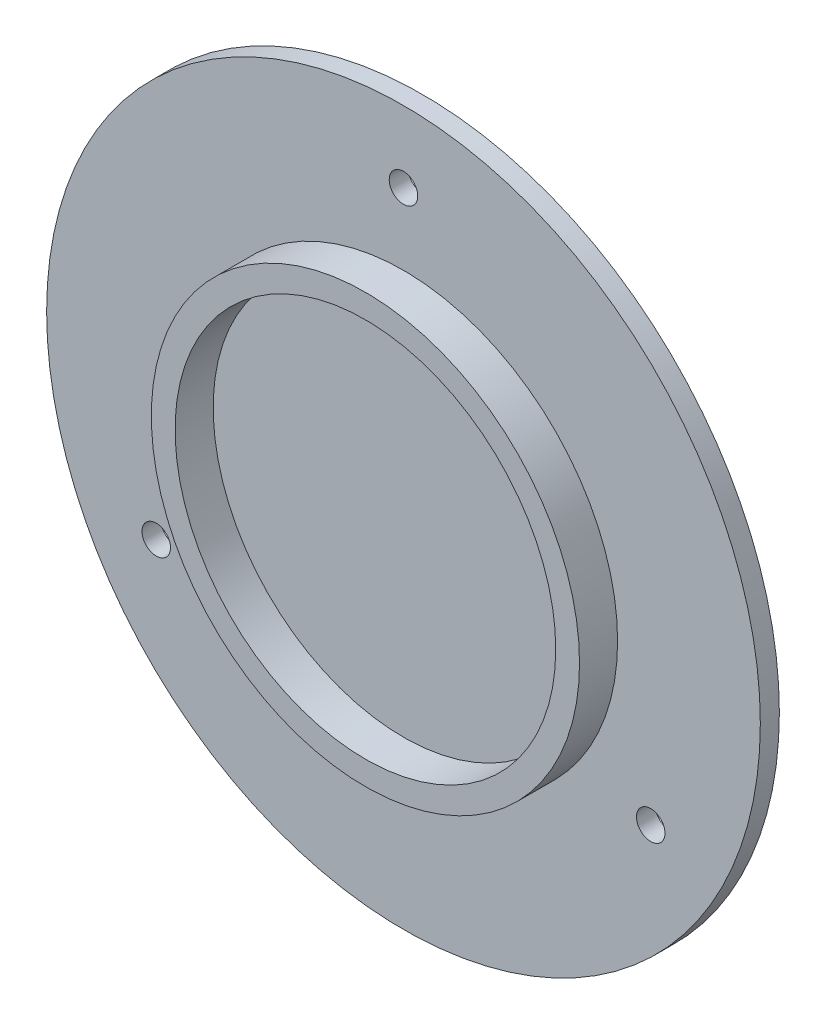
ISO-10303-21;
HEADER;
FILE_DESCRIPTION(('STEP AP214'),'2;1');
FILE_NAME('part.step','',(''),(''),'','','');
FILE_SCHEMA(('AUTOMOTIVE_DESIGN { 1 0 10303 214 1 1 1 1 }'));
ENDSEC;
DATA;
#1=APPLICATION_CONTEXT('core data for automotive mechanical design processes');
#2=APPLICATION_PROTOCOL_DEFINITION('international standard','automotive_design',2000,#1);
#3=PRODUCT_CONTEXT('',#1,'mechanical');
#4=PRODUCT('Part','Part','',(#3));
#5=PRODUCT_RELATED_PRODUCT_CATEGORY('part','',(#4));
#6=PRODUCT_DEFINITION_FORMATION('','',#4);
#7=PRODUCT_DEFINITION_CONTEXT('part definition',#1,'design');
#8=PRODUCT_DEFINITION('design','',#6,#7);
#9=PRODUCT_DEFINITION_SHAPE('','',#8);
#10=(LENGTH_UNIT() NAMED_UNIT(*) SI_UNIT(.MILLI.,.METRE.));
#11=(NAMED_UNIT(*) PLANE_ANGLE_UNIT() SI_UNIT($,.RADIAN.));
#12=(NAMED_UNIT(*) SI_UNIT($,.STERADIAN.) SOLID_ANGLE_UNIT());
#13=UNCERTAINTY_MEASURE_WITH_UNIT(LENGTH_MEASURE(1.E-05),#10,'distance_accuracy_value','');
#14=(GEOMETRIC_REPRESENTATION_CONTEXT(3) GLOBAL_UNCERTAINTY_ASSIGNED_CONTEXT((#13)) GLOBAL_UNIT_ASSIGNED_CONTEXT((#10,
#11,#12)) REPRESENTATION_CONTEXT('',''));
#15=CARTESIAN_POINT('',(0.,0.,0.));
#16=DIRECTION('',(0.,0.,1.));
#17=DIRECTION('',(1.,0.,0.));
#18=AXIS2_PLACEMENT_3D('',#15,#16,#17);
#19=CARTESIAN_POINT('',(0.,0.,4.));
#20=DIRECTION('',(0.,0.,-1.));
#21=DIRECTION('',(-1.,0.,0.));
#22=AXIS2_PLACEMENT_3D('',#19,#20,#21);
#23=CYLINDRICAL_SURFACE('',#22,75.);
#24=CARTESIAN_POINT('',(0.,0.,4.));
#25=DIRECTION('',(0.,0.,1.));
#26=DIRECTION('',(1.,0.,0.));
#27=AXIS2_PLACEMENT_3D('',#24,#25,#26);
#28=CIRCLE('',#27,75.);
#29=CARTESIAN_POINT('',(75.,0.,4.));
#30=VERTEX_POINT('',#29);
#31=EDGE_CURVE('E44',#30,#30,#28,.T.);
#32=ORIENTED_EDGE('',*,*,#31,.F.);
#33=EDGE_LOOP('',(#32));
#34=FACE_BOUND('',#33,.T.);
#35=CARTESIAN_POINT('',(0.,0.,0.));
#36=DIRECTION('',(0.,0.,1.));
#37=DIRECTION('',(1.,0.,0.));
#38=AXIS2_PLACEMENT_3D('',#35,#36,#37);
#39=CIRCLE('',#38,75.);
#40=CARTESIAN_POINT('',(75.,0.,0.));
#41=VERTEX_POINT('',#40);
#42=EDGE_CURVE('E49',#41,#41,#39,.T.);
#43=ORIENTED_EDGE('',*,*,#42,.T.);
#44=EDGE_LOOP('',(#43));
#45=FACE_BOUND('',#44,.T.);
#46=ADVANCED_FACE('F37',(#34,#45),#23,.T.);
#47=CARTESIAN_POINT('',(0.,0.,4.));
#48=DIRECTION('',(0.,0.,1.));
#49=DIRECTION('',(1.,0.,0.));
#50=AXIS2_PLACEMENT_3D('',#47,#48,#49);
#51=PLANE('',#50);
#52=CARTESIAN_POINT('',(-51.9615242270702,-29.9999999999978,4.));
#53=DIRECTION('',(0.,0.,1.));
#54=DIRECTION('',(1.,0.,0.));
#55=AXIS2_PLACEMENT_3D('',#52,#53,#54);
#56=CIRCLE('',#55,3.00000000000332);
#57=CARTESIAN_POINT('',(-48.9615242270668,-29.9999999999978,4.));
#58=VERTEX_POINT('',#57);
#59=EDGE_CURVE('E68',#58,#58,#56,.T.);
#60=ORIENTED_EDGE('',*,*,#59,.F.);
#61=EDGE_LOOP('',(#60));
#62=FACE_BOUND('',#61,.T.);
#63=CARTESIAN_POINT('',(0.,60.,4.));
#64=DIRECTION('',(0.,0.,1.));
#65=DIRECTION('',(1.,0.,0.));
#66=AXIS2_PLACEMENT_3D('',#63,#64,#65);
#67=CIRCLE('',#66,3.);
#68=CARTESIAN_POINT('',(3.,60.,4.));
#69=VERTEX_POINT('',#68);
#70=EDGE_CURVE('E72',#69,#69,#67,.T.);
#71=ORIENTED_EDGE('',*,*,#70,.F.);
#72=EDGE_LOOP('',(#71));
#73=FACE_BOUND('',#72,.T.);
#74=CARTESIAN_POINT('',(51.9615242270625,-30.0000000000022,4.));
#75=DIRECTION('',(0.,0.,1.));
#76=DIRECTION('',(1.,0.,0.));
#77=AXIS2_PLACEMENT_3D('',#74,#75,#76);
#78=CIRCLE('',#77,3.00000000000486);
#79=CARTESIAN_POINT('',(54.9615242270674,-30.0000000000022,4.));
#80=VERTEX_POINT('',#79);
#81=EDGE_CURVE('E76',#80,#80,#78,.T.);
#82=ORIENTED_EDGE('',*,*,#81,.F.);
#83=EDGE_LOOP('',(#82));
#84=FACE_BOUND('',#83,.T.);
#85=CARTESIAN_POINT('',(0.,0.,4.));
#86=DIRECTION('',(0.,0.,1.));
#87=DIRECTION('',(1.,0.,0.));
#88=AXIS2_PLACEMENT_3D('',#85,#86,#87);
#89=CIRCLE('',#88,45.);
#90=CARTESIAN_POINT('',(45.,0.,4.));
#91=VERTEX_POINT('',#90);
#92=EDGE_CURVE('E57',#91,#91,#89,.T.);
#93=ORIENTED_EDGE('',*,*,#92,.F.);
#94=EDGE_LOOP('',(#93));
#95=FACE_BOUND('',#94,.T.);
#96=ORIENTED_EDGE('',*,*,#31,.T.);
#97=EDGE_LOOP('',(#96));
#98=FACE_BOUND('',#97,.T.);
#99=ADVANCED_FACE('F99',(#62,#73,#84,#95,#98),#51,.T.);
#100=CARTESIAN_POINT('',(0.,0.,0.));
#101=DIRECTION('',(0.,0.,1.));
#102=DIRECTION('',(1.,0.,0.));
#103=AXIS2_PLACEMENT_3D('',#100,#101,#102);
#104=PLANE('',#103);
#105=CARTESIAN_POINT('',(-51.9615242270702,-29.9999999999978,0.));
#106=DIRECTION('',(0.,0.,-1.));
#107=DIRECTION('',(-1.,0.,0.));
#108=AXIS2_PLACEMENT_3D('',#105,#106,#107);
#109=CIRCLE('',#108,3.00000000000332);
#110=CARTESIAN_POINT('',(-54.9615242270735,-29.9999999999978,0.));
#111=VERTEX_POINT('',#110);
#112=EDGE_CURVE('E80',#111,#111,#109,.T.);
#113=ORIENTED_EDGE('',*,*,#112,.F.);
#114=EDGE_LOOP('',(#113));
#115=FACE_BOUND('',#114,.T.);
#116=CARTESIAN_POINT('',(0.,60.,0.));
#117=DIRECTION('',(0.,0.,-1.));
#118=DIRECTION('',(-1.,0.,0.));
#119=AXIS2_PLACEMENT_3D('',#116,#117,#118);
#120=CIRCLE('',#119,3.);
#121=CARTESIAN_POINT('',(-3.,60.,0.));
#122=VERTEX_POINT('',#121);
#123=EDGE_CURVE('E85',#122,#122,#120,.T.);
#124=ORIENTED_EDGE('',*,*,#123,.F.);
#125=EDGE_LOOP('',(#124));
#126=FACE_BOUND('',#125,.T.);
#127=CARTESIAN_POINT('',(51.9615242270625,-30.0000000000022,0.));
#128=DIRECTION('',(0.,0.,-1.));
#129=DIRECTION('',(-1.,0.,0.));
#130=AXIS2_PLACEMENT_3D('',#127,#128,#129);
#131=CIRCLE('',#130,3.00000000000486);
#132=CARTESIAN_POINT('',(48.9615242270576,-30.0000000000022,0.));
#133=VERTEX_POINT('',#132);
#134=EDGE_CURVE('E81',#133,#133,#131,.T.);
#135=ORIENTED_EDGE('',*,*,#134,.F.);
#136=EDGE_LOOP('',(#135));
#137=FACE_BOUND('',#136,.T.);
#138=ORIENTED_EDGE('',*,*,#42,.F.);
#139=EDGE_LOOP('',(#138));
#140=FACE_BOUND('',#139,.T.);
#141=ADVANCED_FACE('F95',(#115,#126,#137,#140),#104,.F.);
#142=CARTESIAN_POINT('',(0.,0.,12.));
#143=DIRECTION('',(0.,0.,1.));
#144=DIRECTION('',(1.,0.,0.));
#145=AXIS2_PLACEMENT_3D('',#142,#143,#144);
#146=PLANE('',#145);
#147=CARTESIAN_POINT('',(0.,0.,12.));
#148=DIRECTION('',(0.,0.,1.));
#149=DIRECTION('',(1.,0.,0.));
#150=AXIS2_PLACEMENT_3D('',#147,#148,#149);
#151=CIRCLE('',#150,45.);
#152=CARTESIAN_POINT('',(45.,0.,12.));
#153=VERTEX_POINT('',#152);
#154=EDGE_CURVE('E55',#153,#153,#151,.T.);
#155=ORIENTED_EDGE('',*,*,#154,.T.);
#156=EDGE_LOOP('',(#155));
#157=FACE_BOUND('',#156,.T.);
#158=CARTESIAN_POINT('',(0.,0.,12.));
#159=DIRECTION('',(0.,0.,1.));
#160=DIRECTION('',(1.,0.,0.));
#161=AXIS2_PLACEMENT_3D('',#158,#159,#160);
#162=CIRCLE('',#161,40.);
#163=CARTESIAN_POINT('',(40.,0.,12.));
#164=VERTEX_POINT('',#163);
#165=EDGE_CURVE('E61',#164,#164,#162,.T.);
#166=ORIENTED_EDGE('',*,*,#165,.F.);
#167=EDGE_LOOP('',(#166));
#168=FACE_BOUND('',#167,.T.);
#169=ADVANCED_FACE('F98',(#157,#168),#146,.T.);
#170=CARTESIAN_POINT('',(0.,0.,12.));
#171=DIRECTION('',(0.,0.,-1.));
#172=DIRECTION('',(-1.,0.,0.));
#173=AXIS2_PLACEMENT_3D('',#170,#171,#172);
#174=CYLINDRICAL_SURFACE('',#173,45.);
#175=ORIENTED_EDGE('',*,*,#154,.F.);
#176=EDGE_LOOP('',(#175));
#177=FACE_BOUND('',#176,.T.);
#178=ORIENTED_EDGE('',*,*,#92,.T.);
#179=EDGE_LOOP('',(#178));
#180=FACE_BOUND('',#179,.T.);
#181=ADVANCED_FACE('F130',(#177,#180),#174,.T.);
#182=CARTESIAN_POINT('',(0.,0.,12.));
#183=DIRECTION('',(0.,0.,-1.));
#184=DIRECTION('',(-1.,0.,0.));
#185=AXIS2_PLACEMENT_3D('',#182,#183,#184);
#186=CYLINDRICAL_SURFACE('',#185,40.);
#187=ORIENTED_EDGE('',*,*,#165,.T.);
#188=EDGE_LOOP('',(#187));
#189=FACE_BOUND('',#188,.T.);
#190=CARTESIAN_POINT('',(0.,0.,4.));
#191=DIRECTION('',(0.,0.,1.));
#192=DIRECTION('',(1.,0.,0.));
#193=AXIS2_PLACEMENT_3D('',#190,#191,#192);
#194=CIRCLE('',#193,40.);
#195=CARTESIAN_POINT('',(40.,0.,4.));
#196=VERTEX_POINT('',#195);
#197=EDGE_CURVE('E10',#196,#196,#194,.F.);
#198=ORIENTED_EDGE('',*,*,#197,.T.);
#199=EDGE_LOOP('',(#198));
#200=FACE_BOUND('',#199,.T.);
#201=ADVANCED_FACE('F121',(#189,#200),#186,.F.);
#202=ORIENTED_EDGE('',*,*,#197,.F.);
#203=EDGE_LOOP('',(#202));
#204=FACE_BOUND('',#203,.T.);
#205=ADVANCED_FACE('F113',(#204),#51,.T.);
#206=CARTESIAN_POINT('',(51.9615242270625,-30.0000000000022,12.));
#207=DIRECTION('',(0.,0.,-1.));
#208=DIRECTION('',(-1.,0.,0.));
#209=AXIS2_PLACEMENT_3D('',#206,#207,#208);
#210=CYLINDRICAL_SURFACE('',#209,3.00000000000486);
#211=ORIENTED_EDGE('',*,*,#81,.T.);
#212=EDGE_LOOP('',(#211));
#213=FACE_BOUND('',#212,.T.);
#214=ORIENTED_EDGE('',*,*,#134,.T.);
#215=EDGE_LOOP('',(#214));
#216=FACE_BOUND('',#215,.T.);
#217=ADVANCED_FACE('F120',(#213,#216),#210,.F.);
#218=CARTESIAN_POINT('',(0.,60.,12.));
#219=DIRECTION('',(0.,0.,-1.));
#220=DIRECTION('',(-1.,0.,0.));
#221=AXIS2_PLACEMENT_3D('',#218,#219,#220);
#222=CYLINDRICAL_SURFACE('',#221,3.);
#223=ORIENTED_EDGE('',*,*,#70,.T.);
#224=EDGE_LOOP('',(#223));
#225=FACE_BOUND('',#224,.T.);
#226=ORIENTED_EDGE('',*,*,#123,.T.);
#227=EDGE_LOOP('',(#226));
#228=FACE_BOUND('',#227,.T.);
#229=ADVANCED_FACE('F127',(#225,#228),#222,.F.);
#230=CARTESIAN_POINT('',(-51.9615242270702,-29.9999999999978,12.));
#231=DIRECTION('',(0.,0.,-1.));
#232=DIRECTION('',(-1.,0.,0.));
#233=AXIS2_PLACEMENT_3D('',#230,#231,#232);
#234=CYLINDRICAL_SURFACE('',#233,3.00000000000332);
#235=ORIENTED_EDGE('',*,*,#59,.T.);
#236=EDGE_LOOP('',(#235));
#237=FACE_BOUND('',#236,.T.);
#238=ORIENTED_EDGE('',*,*,#112,.T.);
#239=EDGE_LOOP('',(#238));
#240=FACE_BOUND('',#239,.T.);
#241=ADVANCED_FACE('F93',(#237,#240),#234,.F.);
#242=CLOSED_SHELL('',(#46,#99,#141,#169,#181,#201,#205,#217,#229,#241));
#243=MANIFOLD_SOLID_BREP('B2',#242);
#244=ADVANCED_BREP_SHAPE_REPRESENTATION('',(#18,#243),#14);
#245=SHAPE_DEFINITION_REPRESENTATION(#9,#244);
ENDSEC;
END-ISO-10303-21;
